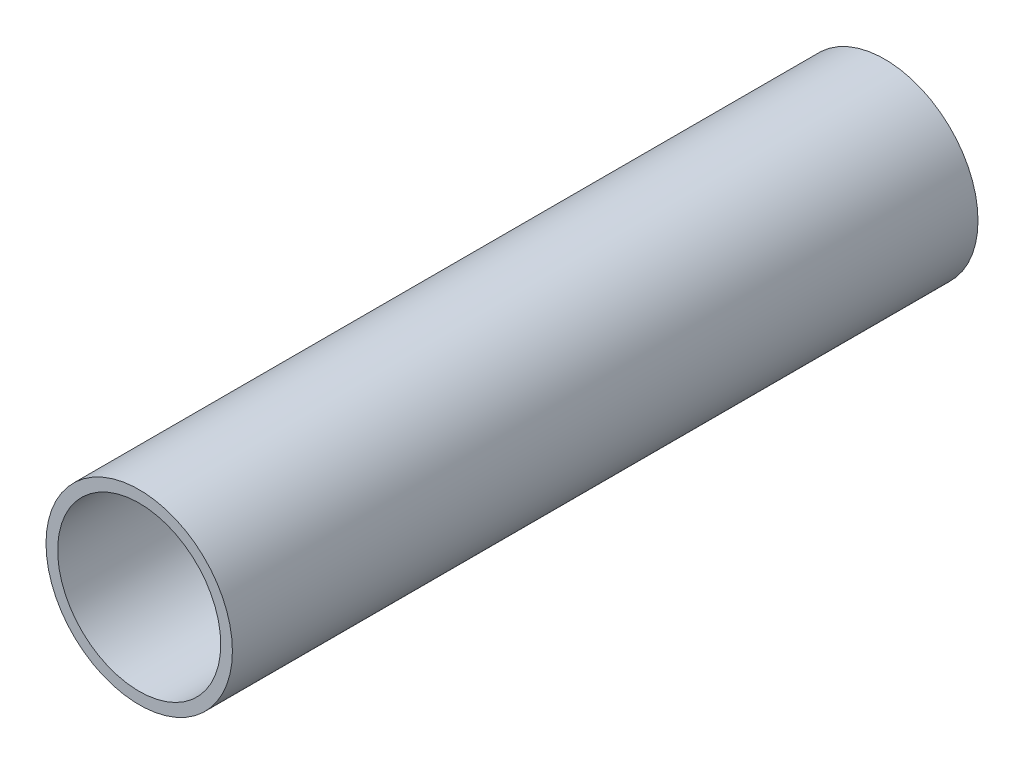
ISO-10303-21;
HEADER;
FILE_DESCRIPTION(('STEP AP214'),'2;1');
FILE_NAME('part.step','',(''),(''),'','','');
FILE_SCHEMA(('AUTOMOTIVE_DESIGN { 1 0 10303 214 1 1 1 1 }'));
ENDSEC;
DATA;
#1=APPLICATION_CONTEXT('core data for automotive mechanical design processes');
#2=APPLICATION_PROTOCOL_DEFINITION('international standard','automotive_design',2000,#1);
#3=PRODUCT_CONTEXT('',#1,'mechanical');
#4=PRODUCT('Part','Part','',(#3));
#5=PRODUCT_RELATED_PRODUCT_CATEGORY('part','',(#4));
#6=PRODUCT_DEFINITION_FORMATION('','',#4);
#7=PRODUCT_DEFINITION_CONTEXT('part definition',#1,'design');
#8=PRODUCT_DEFINITION('design','',#6,#7);
#9=PRODUCT_DEFINITION_SHAPE('','',#8);
#10=(LENGTH_UNIT() NAMED_UNIT(*) SI_UNIT(.MILLI.,.METRE.));
#11=(NAMED_UNIT(*) PLANE_ANGLE_UNIT() SI_UNIT($,.RADIAN.));
#12=(NAMED_UNIT(*) SI_UNIT($,.STERADIAN.) SOLID_ANGLE_UNIT());
#13=UNCERTAINTY_MEASURE_WITH_UNIT(LENGTH_MEASURE(1.E-05),#10,'distance_accuracy_value','');
#14=(GEOMETRIC_REPRESENTATION_CONTEXT(3) GLOBAL_UNCERTAINTY_ASSIGNED_CONTEXT((#13)) GLOBAL_UNIT_ASSIGNED_CONTEXT((#10,
#11,#12)) REPRESENTATION_CONTEXT('',''));
#15=CARTESIAN_POINT('',(0.,0.,0.));
#16=DIRECTION('',(0.,0.,1.));
#17=DIRECTION('',(1.,0.,0.));
#18=AXIS2_PLACEMENT_3D('',#15,#16,#17);
#19=CARTESIAN_POINT('',(0.,0.,101.6));
#20=DIRECTION('',(0.,0.,1.));
#21=DIRECTION('',(1.,0.,0.));
#22=AXIS2_PLACEMENT_3D('',#19,#20,#21);
#23=PLANE('',#22);
#24=CARTESIAN_POINT('',(0.,0.,101.6));
#25=DIRECTION('',(0.,0.,1.));
#26=DIRECTION('',(1.,0.,0.));
#27=AXIS2_PLACEMENT_3D('',#24,#25,#26);
#28=CIRCLE('',#27,12.7);
#29=CARTESIAN_POINT('',(12.7,0.,101.6));
#30=VERTEX_POINT('',#29);
#31=EDGE_CURVE('E10',#30,#30,#28,.T.);
#32=ORIENTED_EDGE('',*,*,#31,.T.);
#33=EDGE_LOOP('',(#32));
#34=FACE_BOUND('',#33,.T.);
#35=CARTESIAN_POINT('',(0.,0.,101.6));
#36=DIRECTION('',(0.,0.,1.));
#37=DIRECTION('',(1.,0.,0.));
#38=AXIS2_PLACEMENT_3D('',#35,#36,#37);
#39=CIRCLE('',#38,11.1125);
#40=CARTESIAN_POINT('',(11.1125,0.,101.6));
#41=VERTEX_POINT('',#40);
#42=EDGE_CURVE('E52',#41,#41,#39,.T.);
#43=ORIENTED_EDGE('',*,*,#42,.F.);
#44=EDGE_LOOP('',(#43));
#45=FACE_BOUND('',#44,.T.);
#46=ADVANCED_FACE('F41',(#34,#45),#23,.T.);
#47=CARTESIAN_POINT('',(0.,0.,0.));
#48=DIRECTION('',(0.,0.,1.));
#49=DIRECTION('',(1.,0.,0.));
#50=AXIS2_PLACEMENT_3D('',#47,#48,#49);
#51=PLANE('',#50);
#52=CARTESIAN_POINT('',(0.,0.,0.));
#53=DIRECTION('',(0.,0.,1.));
#54=DIRECTION('',(1.,0.,0.));
#55=AXIS2_PLACEMENT_3D('',#52,#53,#54);
#56=CIRCLE('',#55,12.7);
#57=CARTESIAN_POINT('',(12.7,0.,0.));
#58=VERTEX_POINT('',#57);
#59=EDGE_CURVE('E45',#58,#58,#56,.T.);
#60=ORIENTED_EDGE('',*,*,#59,.F.);
#61=EDGE_LOOP('',(#60));
#62=FACE_BOUND('',#61,.T.);
#63=CARTESIAN_POINT('',(0.,0.,0.));
#64=DIRECTION('',(0.,0.,1.));
#65=DIRECTION('',(1.,0.,0.));
#66=AXIS2_PLACEMENT_3D('',#63,#64,#65);
#67=CIRCLE('',#66,11.1125);
#68=CARTESIAN_POINT('',(11.1125,0.,0.));
#69=VERTEX_POINT('',#68);
#70=EDGE_CURVE('E54',#69,#69,#67,.T.);
#71=ORIENTED_EDGE('',*,*,#70,.T.);
#72=EDGE_LOOP('',(#71));
#73=FACE_BOUND('',#72,.T.);
#74=ADVANCED_FACE('F64',(#62,#73),#51,.F.);
#75=CARTESIAN_POINT('',(0.,0.,101.6));
#76=DIRECTION('',(0.,0.,-1.));
#77=DIRECTION('',(-1.,0.,0.));
#78=AXIS2_PLACEMENT_3D('',#75,#76,#77);
#79=CYLINDRICAL_SURFACE('',#78,12.7);
#80=ORIENTED_EDGE('',*,*,#31,.F.);
#81=EDGE_LOOP('',(#80));
#82=FACE_BOUND('',#81,.T.);
#83=ORIENTED_EDGE('',*,*,#59,.T.);
#84=EDGE_LOOP('',(#83));
#85=FACE_BOUND('',#84,.T.);
#86=ADVANCED_FACE('F43',(#82,#85),#79,.T.);
#87=CARTESIAN_POINT('',(0.,0.,101.6));
#88=DIRECTION('',(0.,0.,-1.));
#89=DIRECTION('',(-1.,0.,0.));
#90=AXIS2_PLACEMENT_3D('',#87,#88,#89);
#91=CYLINDRICAL_SURFACE('',#90,11.1125);
#92=ORIENTED_EDGE('',*,*,#42,.T.);
#93=EDGE_LOOP('',(#92));
#94=FACE_BOUND('',#93,.T.);
#95=ORIENTED_EDGE('',*,*,#70,.F.);
#96=EDGE_LOOP('',(#95));
#97=FACE_BOUND('',#96,.T.);
#98=ADVANCED_FACE('F60',(#94,#97),#91,.F.);
#99=CLOSED_SHELL('',(#46,#74,#86,#98));
#100=MANIFOLD_SOLID_BREP('B2',#99);
#101=ADVANCED_BREP_SHAPE_REPRESENTATION('',(#18,#100),#14);
#102=SHAPE_DEFINITION_REPRESENTATION(#9,#101);
ENDSEC;
END-ISO-10303-21;
